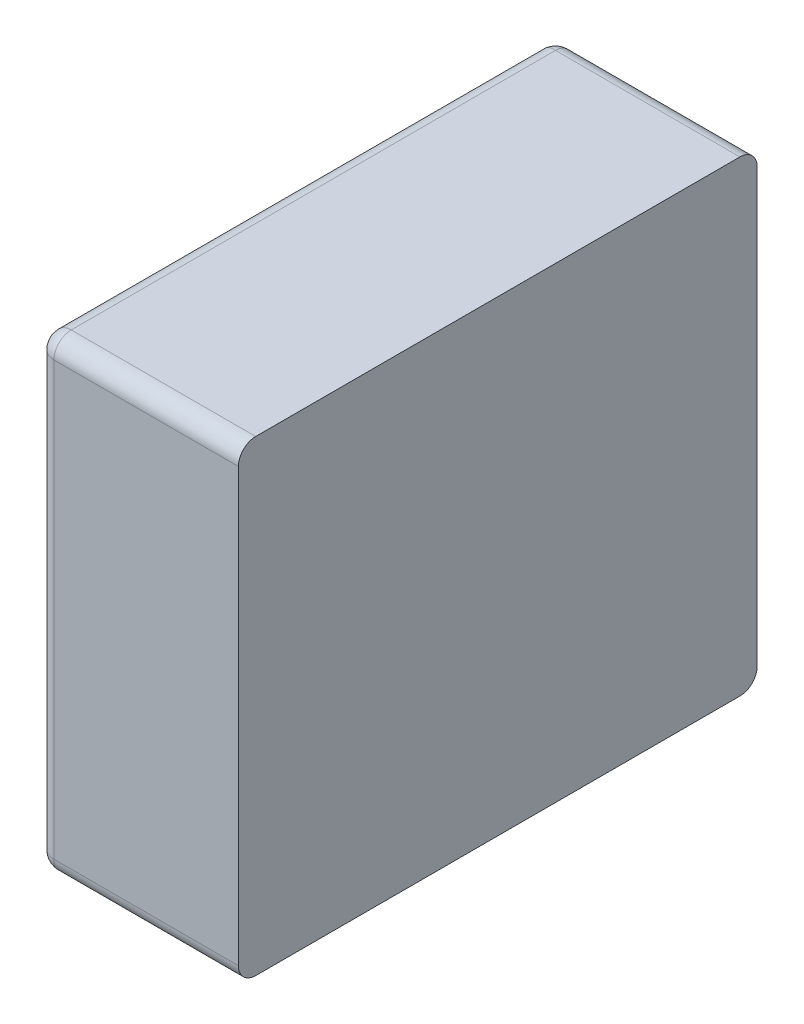
ISO-10303-21;
HEADER;
FILE_DESCRIPTION(('STEP AP214'),'2;1');
FILE_NAME('part.step','',(''),(''),'','','');
FILE_SCHEMA(('AUTOMOTIVE_DESIGN { 1 0 10303 214 1 1 1 1 }'));
ENDSEC;
DATA;
#1=APPLICATION_CONTEXT('core data for automotive mechanical design processes');
#2=APPLICATION_PROTOCOL_DEFINITION('international standard','automotive_design',2000,#1);
#3=PRODUCT_CONTEXT('',#1,'mechanical');
#4=PRODUCT('Part','Part','',(#3));
#5=PRODUCT_RELATED_PRODUCT_CATEGORY('part','',(#4));
#6=PRODUCT_DEFINITION_FORMATION('','',#4);
#7=PRODUCT_DEFINITION_CONTEXT('part definition',#1,'design');
#8=PRODUCT_DEFINITION('design','',#6,#7);
#9=PRODUCT_DEFINITION_SHAPE('','',#8);
#10=(LENGTH_UNIT() NAMED_UNIT(*) SI_UNIT(.MILLI.,.METRE.));
#11=(NAMED_UNIT(*) PLANE_ANGLE_UNIT() SI_UNIT($,.RADIAN.));
#12=(NAMED_UNIT(*) SI_UNIT($,.STERADIAN.) SOLID_ANGLE_UNIT());
#13=UNCERTAINTY_MEASURE_WITH_UNIT(LENGTH_MEASURE(1.E-05),#10,'distance_accuracy_value','');
#14=(GEOMETRIC_REPRESENTATION_CONTEXT(3) GLOBAL_UNCERTAINTY_ASSIGNED_CONTEXT((#13)) GLOBAL_UNIT_ASSIGNED_CONTEXT((#10,
#11,#12)) REPRESENTATION_CONTEXT('',''));
#15=CARTESIAN_POINT('',(0.,0.,0.));
#16=DIRECTION('',(0.,0.,1.));
#17=DIRECTION('',(1.,0.,0.));
#18=AXIS2_PLACEMENT_3D('',#15,#16,#17);
#19=CARTESIAN_POINT('',(-0.77,0.375,0.03));
#20=DIRECTION('',(-0.816496580927725,-0.408248290463864,0.408248290463863));
#21=DIRECTION('',(-0.577350269189627,0.577350269189626,-0.577350269189625));
#22=AXIS2_PLACEMENT_3D('',#19,#20,#21);
#23=SPHERICAL_SURFACE('',#22,0.03);
#24=CARTESIAN_POINT('',(-0.8,0.375,0.03));
#25=CARTESIAN_POINT('',(-0.800000000885541,0.375208920565759,0.0299043319612077));
#26=CARTESIAN_POINT('',(-0.799997360045311,0.3754188571993,0.0298108890156702));
#27=CARTESIAN_POINT('',(-0.799986781704457,0.375841302917413,0.0296280979296212));
#28=CARTESIAN_POINT('',(-0.799978824512546,0.376053818670956,0.0295387663369045));
#29=CARTESIAN_POINT('',(-0.799957560563846,0.376481201194103,0.0293642290897057));
#30=CARTESIAN_POINT('',(-0.79994423389955,0.376696073785566,0.0292790401261315));
#31=CARTESIAN_POINT('',(-0.799912183618114,0.377127947599275,0.0291128108923312));
#32=CARTESIAN_POINT('',(-0.799893439937734,0.377344953783418,0.0290317873885858));
#33=CARTESIAN_POINT('',(-0.799850512107089,0.37778087048501,0.0288739059489271));
#34=CARTESIAN_POINT('',(-0.799826307791658,0.377999785093463,0.0287970647975936));
#35=CARTESIAN_POINT('',(-0.799772419851868,0.378439292053119,0.0286475586064332));
#36=CARTESIAN_POINT('',(-0.799742716016461,0.378659887617396,0.0285749103112036));
#37=CARTESIAN_POINT('',(-0.799677793860668,0.379102531645172,0.0284337933353258));
#38=CARTESIAN_POINT('',(-0.79964255533454,0.37932458245702,0.0283653412999816));
#39=CARTESIAN_POINT('',(-0.799566536092966,0.379769899562591,0.0282326166709339));
#40=CARTESIAN_POINT('',(-0.799525735241222,0.379993167304501,0.0281683605782344));
#41=CARTESIAN_POINT('',(-0.799394737369102,0.380665687375364,0.0279815071011925));
#42=CARTESIAN_POINT('',(-0.79929629941659,0.381115236256513,0.0278655937641843));
#43=CARTESIAN_POINT('',(-0.799077081092125,0.382016435722467,0.0276502506225998));
#44=CARTESIAN_POINT('',(-0.798956143515048,0.38246807783126,0.0275509467609499));
#45=CARTESIAN_POINT('',(-0.79869184908149,0.383371671082917,0.0273685694885411));
#46=CARTESIAN_POINT('',(-0.798548339496165,0.383823601756171,0.0272856160203643));
#47=CARTESIAN_POINT('',(-0.798238911206526,0.384725937163117,0.0271356050355743));
#48=CARTESIAN_POINT('',(-0.798072845692959,0.385176310223073,0.027068660332455));
#49=CARTESIAN_POINT('',(-0.797718393736061,0.386073724852721,0.0269502342175697));
#50=CARTESIAN_POINT('',(-0.797529867626478,0.386520725008768,0.0268988574402047));
#51=CARTESIAN_POINT('',(-0.797130664853887,0.387409608537143,0.0268110444110847));
#52=CARTESIAN_POINT('',(-0.79691985675561,0.387851442274516,0.0267747038269012));
#53=CARTESIAN_POINT('',(-0.796476342722002,0.388728240548299,0.0267163522612807));
#54=CARTESIAN_POINT('',(-0.796243514501363,0.389163148910546,0.0266944274137424));
#55=CARTESIAN_POINT('',(-0.795756296059558,0.390024383436286,0.0266642124365379));
#56=CARTESIAN_POINT('',(-0.795501793454286,0.390450648652353,0.0266559985720434));
#57=CARTESIAN_POINT('',(-0.794971645342014,0.391292931267141,0.0266524308733058));
#58=CARTESIAN_POINT('',(-0.794695897931203,0.391708884767313,0.026657143323895));
#59=CARTESIAN_POINT('',(-0.794123762407378,0.392528933009151,0.02667857848155));
#60=CARTESIAN_POINT('',(-0.793827283277693,0.392932962741796,0.0266953575967929));
#61=CARTESIAN_POINT('',(-0.793214269055406,0.393727614334856,0.026740006309045));
#62=CARTESIAN_POINT('',(-0.792897654069066,0.394118171903413,0.0267679227444279));
#63=CARTESIAN_POINT('',(-0.792245034475514,0.394884398697805,0.0268338617945845));
#64=CARTESIAN_POINT('',(-0.791908961165091,0.395260006134148,0.0268719221736245));
#65=CARTESIAN_POINT('',(-0.79121817154898,0.395994927323628,0.026957106102435));
#66=CARTESIAN_POINT('',(-0.790863397634121,0.396354183506085,0.0270042590105575));
#67=CARTESIAN_POINT('',(-0.790136032021387,0.397055078090956,0.0271065324253754));
#68=CARTESIAN_POINT('',(-0.789763393553022,0.397396664765597,0.0271616747073124));
#69=CARTESIAN_POINT('',(-0.789001200561672,0.398060983194026,0.0272787851655132));
#70=CARTESIAN_POINT('',(-0.788611609698811,0.398383670573753,0.0273407684922153));
#71=CARTESIAN_POINT('',(-0.787816487725631,0.399009045509089,0.0274703798902937));
#72=CARTESIAN_POINT('',(-0.787410930152302,0.399311697423408,0.0275380175610654));
#73=CARTESIAN_POINT('',(-0.786584921848203,0.399895953586706,0.0276777239590771));
#74=CARTESIAN_POINT('',(-0.786164453839678,0.400177532158359,0.0277497979031105));
#75=CARTESIAN_POINT('',(-0.78530973989387,0.400718695200802,0.0278971377116832));
#76=CARTESIAN_POINT('',(-0.784875485043225,0.400978265027613,0.0279724056522169));
#77=CARTESIAN_POINT('',(-0.783994377299662,0.401474569391927,0.0281248761075376));
#78=CARTESIAN_POINT('',(-0.78354752291707,0.401711301214479,0.0282020788509604));
#79=CARTESIAN_POINT('',(-0.782642456850724,0.402161196950527,0.0283571507017665));
#80=CARTESIAN_POINT('',(-0.782184250050681,0.402374370790128,0.028435019513488));
#81=CARTESIAN_POINT('',(-0.781257776631302,0.402776529291588,0.0285901518426264));
#82=CARTESIAN_POINT('',(-0.780789520120333,0.40296553704088,0.0286674158705552));
#83=CARTESIAN_POINT('',(-0.779844297105908,0.403318855688421,0.0288200709744449));
#84=CARTESIAN_POINT('',(-0.779367344700468,0.403483203157651,0.0288954646826547));
#85=CARTESIAN_POINT('',(-0.778406127362682,0.403786808810622,0.029043122926288));
#86=CARTESIAN_POINT('',(-0.777921879210046,0.403926117168614,0.0291153934940245));
#87=CARTESIAN_POINT('',(-0.776947510656095,0.40417936863514,0.0292555680794347));
#88=CARTESIAN_POINT('',(-0.776457408349491,0.404293375435409,0.0293234827482828));
#89=CARTESIAN_POINT('',(-0.775472809014332,0.404495864378045,0.0294537342598498));
#90=CARTESIAN_POINT('',(-0.774978329987218,0.404584423439013,0.0295160875099761));
#91=CARTESIAN_POINT('',(-0.773986488076972,0.404735975701535,0.0296340383799985));
#92=CARTESIAN_POINT('',(-0.773489141663646,0.404799058547557,0.0296896591970139));
#93=CARTESIAN_POINT('',(-0.772493098142923,0.404899728520835,0.0297930071991365));
#94=CARTESIAN_POINT('',(-0.771994414549251,0.404937417339022,0.0298407652826262));
#95=CARTESIAN_POINT('',(-0.770997266674897,0.404987502790529,0.0299272990130659));
#96=CARTESIAN_POINT('',(-0.7704988114566,0.40500001218838,0.0299661140154709));
#97=CARTESIAN_POINT('',(-0.77,0.405,0.0299999999999999));
#98=B_SPLINE_CURVE_WITH_KNOTS('',3,(#24,#25,#26,#27,#28,#29,#30,#31,#32,#33,#34,#35,#36,#37,#38,
#39,#40,#41,#42,#43,#44,#45,#46,#47,#48,#49,#50,#51,#52,#53,#54,#55,#56,#57,#58,#59,#60,#61,#62,
#63,#64,#65,#66,#67,#68,#69,#70,#71,#72,#73,#74,#75,#76,#77,#78,#79,#80,#81,#82,#83,#84,#85,#86,
#87,#88,#89,#90,#91,#92,#93,#94,#95,#96,#97),.UNSPECIFIED.,.F.,.F.,(4,2,2,2,2,2,2,2,2,2,2,2,2,2,
2,2,2,2,2,2,2,2,2,2,2,2,2,2,2,2,2,2,2,2,2,2,4),(0.,0.000689316766648968,0.00138120096010763,
0.00207567429615539,0.00277275348984124,0.00347245028002031,0.00417477146326371,
0.00487971893664834,0.00558728974893888,0.0070101117567409,0.00844327621530548,
0.00988659180487091,0.0113397969739223,0.0128025631197324,0.0142744980597442,0.0157551497509969,
0.0172440102195327,0.0187405196662893,0.0202440707202696,0.0217540128137278,0.0232696566576618,
0.0247902787990631,0.0263151262441233,0.0278434211339502,0.0293743654613289,0.0309071458186774,
0.032440938168626,0.0339749126296049,0.0355082382694748,0.0370400879005887,0.0385696428697322,
0.0400960978361721,0.0416186655305149,0.0431365814862649,0.0446491087348324,0.0461555424532762,
0.0476552145522494),.UNSPECIFIED.);
#99=CARTESIAN_POINT('',(-0.8,0.375,0.03));
#100=VERTEX_POINT('',#99);
#101=CARTESIAN_POINT('',(-0.77,0.405,0.03));
#102=VERTEX_POINT('',#101);
#103=EDGE_CURVE('E11',#100,#102,#98,.T.);
#104=ORIENTED_EDGE('',*,*,#103,.T.);
#105=CARTESIAN_POINT('',(-0.77,0.375,0.03));
#106=DIRECTION('',(-1.,0.,0.));
#107=DIRECTION('',(0.,0.,-1.));
#108=AXIS2_PLACEMENT_3D('',#105,#106,#107);
#109=CIRCLE('',#108,0.03);
#110=CARTESIAN_POINT('',(-0.77,0.375,0.));
#111=VERTEX_POINT('',#110);
#112=EDGE_CURVE('E25',#102,#111,#109,.T.);
#113=ORIENTED_EDGE('',*,*,#112,.T.);
#114=CARTESIAN_POINT('',(-0.77,0.375,0.03));
#115=DIRECTION('',(0.,1.,0.));
#116=DIRECTION('',(-1.,0.,0.));
#117=AXIS2_PLACEMENT_3D('',#114,#115,#116);
#118=CIRCLE('',#117,0.03);
#119=EDGE_CURVE('E248',#111,#100,#118,.T.);
#120=ORIENTED_EDGE('',*,*,#119,.T.);
#121=EDGE_LOOP('',(#104,#113,#120));
#122=FACE_BOUND('',#121,.T.);
#123=ADVANCED_FACE('F17',(#122),#23,.T.);
#124=CARTESIAN_POINT('',(-0.4,0.375,0.03));
#125=DIRECTION('',(-1.,0.,0.));
#126=DIRECTION('',(0.,0.707106781186548,-0.707106781186547));
#127=AXIS2_PLACEMENT_3D('',#124,#125,#126);
#128=CYLINDRICAL_SURFACE('',#127,0.03);
#129=CARTESIAN_POINT('',(-0.45,0.375,0.03));
#130=DIRECTION('',(-1.,0.,0.));
#131=DIRECTION('',(0.,0.707106781186548,-0.707106781186547));
#132=AXIS2_PLACEMENT_3D('',#129,#130,#131);
#133=CIRCLE('',#132,0.03);
#134=CARTESIAN_POINT('',(-0.45,0.405,0.03));
#135=VERTEX_POINT('',#134);
#136=CARTESIAN_POINT('',(-0.45,0.375,0.));
#137=VERTEX_POINT('',#136);
#138=EDGE_CURVE('E246',#135,#137,#133,.T.);
#139=ORIENTED_EDGE('',*,*,#138,.T.);
#140=DIRECTION('',(-1.,0.,0.));
#141=VECTOR('',#140,1.);
#142=CARTESIAN_POINT('',(-0.4,0.375,0.));
#143=LINE('',#142,#141);
#144=EDGE_CURVE('E243',#137,#111,#143,.T.);
#145=ORIENTED_EDGE('',*,*,#144,.T.);
#146=ORIENTED_EDGE('',*,*,#112,.F.);
#147=DIRECTION('',(1.,0.,0.));
#148=VECTOR('',#147,1.);
#149=CARTESIAN_POINT('',(-0.4,0.405,0.03));
#150=LINE('',#149,#148);
#151=EDGE_CURVE('E238',#102,#135,#150,.T.);
#152=ORIENTED_EDGE('',*,*,#151,.T.);
#153=EDGE_LOOP('',(#139,#145,#146,#152));
#154=FACE_BOUND('',#153,.T.);
#155=ADVANCED_FACE('F278',(#154),#128,.T.);
#156=CARTESIAN_POINT('',(-0.77,-0.375,0.03));
#157=DIRECTION('',(-0.816496580927727,0.408248290463863,0.408248290463862));
#158=DIRECTION('',(-0.577350269189625,-0.577350269189627,-0.577350269189626));
#159=AXIS2_PLACEMENT_3D('',#156,#157,#158);
#160=SPHERICAL_SURFACE('',#159,0.03);
#161=CARTESIAN_POINT('',(-0.77,-0.375,0.03));
#162=DIRECTION('',(0.,-1.,0.));
#163=DIRECTION('',(0.,0.,-1.));
#164=AXIS2_PLACEMENT_3D('',#161,#162,#163);
#165=CIRCLE('',#164,0.03);
#166=CARTESIAN_POINT('',(-0.8,-0.375,0.03));
#167=VERTEX_POINT('',#166);
#168=CARTESIAN_POINT('',(-0.77,-0.375,0.));
#169=VERTEX_POINT('',#168);
#170=EDGE_CURVE('E236',#167,#169,#165,.T.);
#171=ORIENTED_EDGE('',*,*,#170,.T.);
#172=CARTESIAN_POINT('',(-0.77,-0.375,0.03));
#173=DIRECTION('',(-1.,0.,0.));
#174=DIRECTION('',(0.,-1.,0.));
#175=AXIS2_PLACEMENT_3D('',#172,#173,#174);
#176=CIRCLE('',#175,0.03);
#177=CARTESIAN_POINT('',(-0.77,-0.405,0.03));
#178=VERTEX_POINT('',#177);
#179=EDGE_CURVE('E234',#169,#178,#176,.T.);
#180=ORIENTED_EDGE('',*,*,#179,.T.);
#181=CARTESIAN_POINT('',(-0.77,-0.375,0.03));
#182=DIRECTION('',(0.,0.,-1.));
#183=DIRECTION('',(-1.,0.,0.));
#184=AXIS2_PLACEMENT_3D('',#181,#182,#183);
#185=CIRCLE('',#184,0.03);
#186=EDGE_CURVE('E231',#178,#167,#185,.T.);
#187=ORIENTED_EDGE('',*,*,#186,.T.);
#188=EDGE_LOOP('',(#171,#180,#187));
#189=FACE_BOUND('',#188,.T.);
#190=ADVANCED_FACE('F290',(#189),#160,.T.);
#191=CARTESIAN_POINT('',(0.4,-0.375,0.03));
#192=DIRECTION('',(1.,0.,0.));
#193=DIRECTION('',(0.,-0.707106781186548,-0.707106781186547));
#194=AXIS2_PLACEMENT_3D('',#191,#192,#193);
#195=CYLINDRICAL_SURFACE('',#194,0.03);
#196=CARTESIAN_POINT('',(-0.45,-0.375,0.03));
#197=DIRECTION('',(-1.,0.,0.));
#198=DIRECTION('',(0.,-0.707106781186548,-0.707106781186547));
#199=AXIS2_PLACEMENT_3D('',#196,#197,#198);
#200=CIRCLE('',#199,0.03);
#201=CARTESIAN_POINT('',(-0.45,-0.375,0.));
#202=VERTEX_POINT('',#201);
#203=CARTESIAN_POINT('',(-0.45,-0.405,0.03));
#204=VERTEX_POINT('',#203);
#205=EDGE_CURVE('E229',#202,#204,#200,.T.);
#206=ORIENTED_EDGE('',*,*,#205,.T.);
#207=DIRECTION('',(-1.,0.,0.));
#208=VECTOR('',#207,1.);
#209=CARTESIAN_POINT('',(0.4,-0.405,0.03));
#210=LINE('',#209,#208);
#211=EDGE_CURVE('E226',#204,#178,#210,.T.);
#212=ORIENTED_EDGE('',*,*,#211,.T.);
#213=ORIENTED_EDGE('',*,*,#179,.F.);
#214=DIRECTION('',(1.,0.,0.));
#215=VECTOR('',#214,1.);
#216=CARTESIAN_POINT('',(0.4,-0.375,0.));
#217=LINE('',#216,#215);
#218=EDGE_CURVE('E223',#169,#202,#217,.T.);
#219=ORIENTED_EDGE('',*,*,#218,.T.);
#220=EDGE_LOOP('',(#206,#212,#213,#219));
#221=FACE_BOUND('',#220,.T.);
#222=ADVANCED_FACE('F285',(#221),#195,.T.);
#223=CARTESIAN_POINT('',(-0.77,0.375,0.87));
#224=DIRECTION('',(-0.408248290463864,-0.816496580927725,0.408248290463864));
#225=DIRECTION('',(-0.577350269189625,0.577350269189627,0.577350269189625));
#226=AXIS2_PLACEMENT_3D('',#223,#224,#225);
#227=SPHERICAL_SURFACE('',#226,0.03);
#228=CARTESIAN_POINT('',(-0.77,0.375,0.87));
#229=DIRECTION('',(-1.,0.,0.));
#230=DIRECTION('',(0.,1.,0.));
#231=AXIS2_PLACEMENT_3D('',#228,#229,#230);
#232=CIRCLE('',#231,0.03);
#233=CARTESIAN_POINT('',(-0.77,0.375,0.9));
#234=VERTEX_POINT('',#233);
#235=CARTESIAN_POINT('',(-0.77,0.405,0.87));
#236=VERTEX_POINT('',#235);
#237=EDGE_CURVE('E108',#234,#236,#232,.T.);
#238=ORIENTED_EDGE('',*,*,#237,.T.);
#239=CARTESIAN_POINT('',(-0.77,0.375,0.87));
#240=DIRECTION('',(0.,0.,1.));
#241=DIRECTION('',(-1.,0.,0.));
#242=AXIS2_PLACEMENT_3D('',#239,#240,#241);
#243=CIRCLE('',#242,0.03);
#244=CARTESIAN_POINT('',(-0.8,0.375,0.87));
#245=VERTEX_POINT('',#244);
#246=EDGE_CURVE('E220',#236,#245,#243,.T.);
#247=ORIENTED_EDGE('',*,*,#246,.T.);
#248=CARTESIAN_POINT('',(-0.77,0.375,0.87));
#249=DIRECTION('',(0.,1.,0.));
#250=DIRECTION('',(0.,0.,1.));
#251=AXIS2_PLACEMENT_3D('',#248,#249,#250);
#252=CIRCLE('',#251,0.03);
#253=EDGE_CURVE('E218',#245,#234,#252,.T.);
#254=ORIENTED_EDGE('',*,*,#253,.T.);
#255=EDGE_LOOP('',(#238,#247,#254));
#256=FACE_BOUND('',#255,.T.);
#257=ADVANCED_FACE('F322',(#256),#227,.T.);
#258=CARTESIAN_POINT('',(-0.77,0.375,0.));
#259=DIRECTION('',(0.,0.,1.));
#260=DIRECTION('',(-0.707106781186548,0.707106781186548,0.));
#261=AXIS2_PLACEMENT_3D('',#258,#259,#260);
#262=CYLINDRICAL_SURFACE('',#261,0.03);
#263=ORIENTED_EDGE('',*,*,#246,.F.);
#264=DIRECTION('',(0.,0.,-1.));
#265=VECTOR('',#264,1.);
#266=CARTESIAN_POINT('',(-0.77,0.405,0.));
#267=LINE('',#266,#265);
#268=EDGE_CURVE('E214',#236,#102,#267,.T.);
#269=ORIENTED_EDGE('',*,*,#268,.T.);
#270=ORIENTED_EDGE('',*,*,#103,.F.);
#271=DIRECTION('',(0.,0.,1.));
#272=VECTOR('',#271,1.);
#273=CARTESIAN_POINT('',(-0.8,0.375,0.));
#274=LINE('',#273,#272);
#275=EDGE_CURVE('E210',#100,#245,#274,.T.);
#276=ORIENTED_EDGE('',*,*,#275,.T.);
#277=EDGE_LOOP('',(#263,#269,#270,#276));
#278=FACE_BOUND('',#277,.T.);
#279=ADVANCED_FACE('F188',(#278),#262,.T.);
#280=CARTESIAN_POINT('',(-0.77,-0.375,0.87));
#281=DIRECTION('',(0.408248290463864,-0.816496580927725,-0.408248290463864));
#282=DIRECTION('',(-0.577350269189625,-0.577350269189627,0.577350269189625));
#283=AXIS2_PLACEMENT_3D('',#280,#281,#282);
#284=SPHERICAL_SURFACE('',#283,0.03);
#285=CARTESIAN_POINT('',(-0.77,-0.375,0.87));
#286=DIRECTION('',(0.,-1.,0.));
#287=DIRECTION('',(-1.,0.,0.));
#288=AXIS2_PLACEMENT_3D('',#285,#286,#287);
#289=CIRCLE('',#288,0.03);
#290=CARTESIAN_POINT('',(-0.77,-0.375,0.9));
#291=VERTEX_POINT('',#290);
#292=CARTESIAN_POINT('',(-0.8,-0.375,0.87));
#293=VERTEX_POINT('',#292);
#294=EDGE_CURVE('E206',#291,#293,#289,.T.);
#295=ORIENTED_EDGE('',*,*,#294,.T.);
#296=CARTESIAN_POINT('',(-0.77,-0.375,0.87));
#297=DIRECTION('',(0.,0.,1.));
#298=DIRECTION('',(0.,-1.,0.));
#299=AXIS2_PLACEMENT_3D('',#296,#297,#298);
#300=CIRCLE('',#299,0.03);
#301=CARTESIAN_POINT('',(-0.77,-0.405,0.87));
#302=VERTEX_POINT('',#301);
#303=EDGE_CURVE('E204',#293,#302,#300,.T.);
#304=ORIENTED_EDGE('',*,*,#303,.T.);
#305=CARTESIAN_POINT('',(-0.77,-0.405,0.87));
#306=CARTESIAN_POINT('',(-0.770095668038792,-0.405000000885541,0.870208920565759));
#307=CARTESIAN_POINT('',(-0.77018911098433,-0.404997360045311,0.8704188571993));
#308=CARTESIAN_POINT('',(-0.770371902070379,-0.404986781704457,0.870841302917413));
#309=CARTESIAN_POINT('',(-0.770461233663096,-0.404978824512546,0.871053818670956));
#310=CARTESIAN_POINT('',(-0.770635770910294,-0.404957560563846,0.871481201194103));
#311=CARTESIAN_POINT('',(-0.770720959873869,-0.40494423389955,0.871696073785566));
#312=CARTESIAN_POINT('',(-0.770887189107669,-0.404912183618114,0.872127947599275));
#313=CARTESIAN_POINT('',(-0.770968212611414,-0.404893439937734,0.872344953783418));
#314=CARTESIAN_POINT('',(-0.771126094051073,-0.404850512107089,0.87278087048501));
#315=CARTESIAN_POINT('',(-0.771202935202406,-0.404826307791658,0.872999785093463));
#316=CARTESIAN_POINT('',(-0.771352441393567,-0.404772419851868,0.873439292053119));
#317=CARTESIAN_POINT('',(-0.771425089688797,-0.404742716016461,0.873659887617396));
#318=CARTESIAN_POINT('',(-0.771566206664674,-0.404677793860667,0.874102531645172));
#319=CARTESIAN_POINT('',(-0.771634658700019,-0.40464255533454,0.874324582457019));
#320=CARTESIAN_POINT('',(-0.771767383329066,-0.404566536092966,0.874769899562591));
#321=CARTESIAN_POINT('',(-0.771831639421766,-0.404525735241222,0.8749931673045));
#322=CARTESIAN_POINT('',(-0.772018492898808,-0.404394737369101,0.875665687375364));
#323=CARTESIAN_POINT('',(-0.772134406235816,-0.40429629941659,0.876115236256513));
#324=CARTESIAN_POINT('',(-0.7723497493774,-0.404077081092125,0.877016435722467));
#325=CARTESIAN_POINT('',(-0.77244905323905,-0.403956143515048,0.87746807783126));
#326=CARTESIAN_POINT('',(-0.772631430511459,-0.40369184908149,0.878371671082917));
#327=CARTESIAN_POINT('',(-0.772714383979636,-0.403548339496165,0.878823601756171));
#328=CARTESIAN_POINT('',(-0.772864394964426,-0.403238911206526,0.879725937163117));
#329=CARTESIAN_POINT('',(-0.772931339667545,-0.403072845692959,0.880176310223072));
#330=CARTESIAN_POINT('',(-0.77304976578243,-0.402718393736061,0.881073724852721));
#331=CARTESIAN_POINT('',(-0.773101142559795,-0.402529867626478,0.881520725008768));
#332=CARTESIAN_POINT('',(-0.773188955588915,-0.402130664853887,0.882409608537143));
#333=CARTESIAN_POINT('',(-0.773225296173099,-0.40191985675561,0.882851442274516));
#334=CARTESIAN_POINT('',(-0.773283647738719,-0.401476342722002,0.883728240548299));
#335=CARTESIAN_POINT('',(-0.773305572586258,-0.401243514501363,0.884163148910546));
#336=CARTESIAN_POINT('',(-0.773335787563462,-0.400756296059558,0.885024383436286));
#337=CARTESIAN_POINT('',(-0.773344001427957,-0.400501793454286,0.885450648652353));
#338=CARTESIAN_POINT('',(-0.773347569126694,-0.399971645342014,0.886292931267141));
#339=CARTESIAN_POINT('',(-0.773342856676105,-0.399695897931203,0.886708884767313));
#340=CARTESIAN_POINT('',(-0.77332142151845,-0.399123762407378,0.887528933009151));
#341=CARTESIAN_POINT('',(-0.773304642403207,-0.398827283277693,0.887932962741796));
#342=CARTESIAN_POINT('',(-0.773259993690955,-0.398214269055406,0.888727614334856));
#343=CARTESIAN_POINT('',(-0.773232077255572,-0.397897654069066,0.889118171903412));
#344=CARTESIAN_POINT('',(-0.773166138205415,-0.397245034475513,0.889884398697804));
#345=CARTESIAN_POINT('',(-0.773128077826375,-0.396908961165091,0.890260006134148));
#346=CARTESIAN_POINT('',(-0.773042893897565,-0.39621817154898,0.890994927323628));
#347=CARTESIAN_POINT('',(-0.772995740989442,-0.395863397634121,0.891354183506085));
#348=CARTESIAN_POINT('',(-0.772893467574625,-0.395136032021387,0.892055078090956));
#349=CARTESIAN_POINT('',(-0.772838325292687,-0.394763393553022,0.892396664765597));
#350=CARTESIAN_POINT('',(-0.772721214834487,-0.394001200561671,0.893060983194026));
#351=CARTESIAN_POINT('',(-0.772659231507785,-0.393611609698811,0.893383670573753));
#352=CARTESIAN_POINT('',(-0.772529620109706,-0.392816487725631,0.894009045509088));
#353=CARTESIAN_POINT('',(-0.772461982438935,-0.392410930152302,0.894311697423408));
#354=CARTESIAN_POINT('',(-0.772322276040923,-0.391584921848203,0.894895953586706));
#355=CARTESIAN_POINT('',(-0.772250202096889,-0.391164453839678,0.895177532158358));
#356=CARTESIAN_POINT('',(-0.772102862288317,-0.39030973989387,0.895718695200802));
#357=CARTESIAN_POINT('',(-0.772027594347783,-0.389875485043225,0.895978265027613));
#358=CARTESIAN_POINT('',(-0.771875123892462,-0.388994377299662,0.896474569391927));
#359=CARTESIAN_POINT('',(-0.77179792114904,-0.38854752291707,0.896711301214479));
#360=CARTESIAN_POINT('',(-0.771642849298233,-0.387642456850724,0.897161196950527));
#361=CARTESIAN_POINT('',(-0.771564980486512,-0.387184250050681,0.897374370790128));
#362=CARTESIAN_POINT('',(-0.771409848157373,-0.386257776631302,0.897776529291588));
#363=CARTESIAN_POINT('',(-0.771332584129445,-0.385789520120332,0.89796553704088));
#364=CARTESIAN_POINT('',(-0.771179929025555,-0.384844297105908,0.898318855688421));
#365=CARTESIAN_POINT('',(-0.771104535317345,-0.384367344700468,0.898483203157651));
#366=CARTESIAN_POINT('',(-0.770956877073712,-0.383406127362682,0.898786808810621));
#367=CARTESIAN_POINT('',(-0.770884606505975,-0.382921879210045,0.898926117168614));
#368=CARTESIAN_POINT('',(-0.770744431920565,-0.381947510656095,0.89917936863514));
#369=CARTESIAN_POINT('',(-0.770676517251717,-0.381457408349491,0.899293375435409));
#370=CARTESIAN_POINT('',(-0.77054626574015,-0.380472809014332,0.899495864378045));
#371=CARTESIAN_POINT('',(-0.770483912490024,-0.379978329987218,0.899584423439013));
#372=CARTESIAN_POINT('',(-0.770365961620001,-0.378986488076972,0.899735975701535));
#373=CARTESIAN_POINT('',(-0.770310340802986,-0.378489141663646,0.899799058547557));
#374=CARTESIAN_POINT('',(-0.770206992800863,-0.377493098142923,0.899899728520835));
#375=CARTESIAN_POINT('',(-0.770159234717374,-0.376994414549251,0.899937417339022));
#376=CARTESIAN_POINT('',(-0.770072700986934,-0.375997266674897,0.899987502790529));
#377=CARTESIAN_POINT('',(-0.770033885984529,-0.3754988114566,0.90000001218838));
#378=CARTESIAN_POINT('',(-0.77,-0.375,0.9));
#379=B_SPLINE_CURVE_WITH_KNOTS('',3,(#305,#306,#307,#308,#309,#310,#311,#312,#313,#314,#315,
#316,#317,#318,#319,#320,#321,#322,#323,#324,#325,#326,#327,#328,#329,#330,#331,#332,#333,#334,
#335,#336,#337,#338,#339,#340,#341,#342,#343,#344,#345,#346,#347,#348,#349,#350,#351,#352,#353,
#354,#355,#356,#357,#358,#359,#360,#361,#362,#363,#364,#365,#366,#367,#368,#369,#370,#371,#372,
#373,#374,#375,#376,#377,#378),.UNSPECIFIED.,.F.,.F.,(4,2,2,2,2,2,2,2,2,2,2,2,2,2,2,2,2,2,2,2,2,
2,2,2,2,2,2,2,2,2,2,2,2,2,2,2,4),(0.,0.000689316766648959,0.0013812009601076,
0.00207567429615537,0.00277275348984118,0.00347245028002033,0.00417477146326372,
0.00487971893664836,0.0055872897489389,0.0070101117567409,0.00844327621530554,
0.00988659180487091,0.0113397969739223,0.0128025631197325,0.0142744980597442,0.0157551497509969,
0.0172440102195328,0.0187405196662893,0.0202440707202697,0.0217540128137279,0.0232696566576618,
0.0247902787990631,0.0263151262441234,0.0278434211339502,0.0293743654613289,0.0309071458186775,
0.0324409381686261,0.0339749126296049,0.0355082382694749,0.0370400879005888,0.0385696428697324,
0.0400960978361723,0.041618665530515,0.043136581486265,0.0446491087348325,0.0461555424532764,
0.0476552145522495),.UNSPECIFIED.);
#380=EDGE_CURVE('E160',#302,#291,#379,.T.);
#381=ORIENTED_EDGE('',*,*,#380,.T.);
#382=EDGE_LOOP('',(#295,#304,#381));
#383=FACE_BOUND('',#382,.T.);
#384=ADVANCED_FACE('F183',(#383),#284,.T.);
#385=CARTESIAN_POINT('',(-0.77,-0.375,0.));
#386=DIRECTION('',(0.,0.,1.));
#387=DIRECTION('',(-0.707106781186548,-0.707106781186548,0.));
#388=AXIS2_PLACEMENT_3D('',#385,#386,#387);
#389=CYLINDRICAL_SURFACE('',#388,0.03);
#390=ORIENTED_EDGE('',*,*,#303,.F.);
#391=DIRECTION('',(0.,0.,-1.));
#392=VECTOR('',#391,1.);
#393=CARTESIAN_POINT('',(-0.8,-0.375,0.));
#394=LINE('',#393,#392);
#395=EDGE_CURVE('E157',#293,#167,#394,.T.);
#396=ORIENTED_EDGE('',*,*,#395,.T.);
#397=ORIENTED_EDGE('',*,*,#186,.F.);
#398=DIRECTION('',(0.,0.,1.));
#399=VECTOR('',#398,1.);
#400=CARTESIAN_POINT('',(-0.77,-0.405,0.));
#401=LINE('',#400,#399);
#402=EDGE_CURVE('E152',#178,#302,#401,.T.);
#403=ORIENTED_EDGE('',*,*,#402,.T.);
#404=EDGE_LOOP('',(#390,#396,#397,#403));
#405=FACE_BOUND('',#404,.T.);
#406=ADVANCED_FACE('F178',(#405),#389,.T.);
#407=CARTESIAN_POINT('',(0.4,-0.375,0.87));
#408=DIRECTION('',(-1.,0.,0.));
#409=DIRECTION('',(0.,-0.707106781186548,0.707106781186548));
#410=AXIS2_PLACEMENT_3D('',#407,#408,#409);
#411=CYLINDRICAL_SURFACE('',#410,0.03);
#412=CARTESIAN_POINT('',(-0.45,-0.375,0.87));
#413=DIRECTION('',(-1.,0.,0.));
#414=DIRECTION('',(0.,-0.707106781186548,0.707106781186548));
#415=AXIS2_PLACEMENT_3D('',#412,#413,#414);
#416=CIRCLE('',#415,0.03);
#417=CARTESIAN_POINT('',(-0.45,-0.405,0.87));
#418=VERTEX_POINT('',#417);
#419=CARTESIAN_POINT('',(-0.45,-0.375,0.9));
#420=VERTEX_POINT('',#419);
#421=EDGE_CURVE('E150',#418,#420,#416,.T.);
#422=ORIENTED_EDGE('',*,*,#421,.T.);
#423=DIRECTION('',(-1.,0.,0.));
#424=VECTOR('',#423,1.);
#425=CARTESIAN_POINT('',(0.4,-0.375,0.9));
#426=LINE('',#425,#424);
#427=EDGE_CURVE('E117',#420,#291,#426,.T.);
#428=ORIENTED_EDGE('',*,*,#427,.T.);
#429=ORIENTED_EDGE('',*,*,#380,.F.);
#430=DIRECTION('',(1.,0.,0.));
#431=VECTOR('',#430,1.);
#432=CARTESIAN_POINT('',(0.4,-0.405,0.87));
#433=LINE('',#432,#431);
#434=EDGE_CURVE('E142',#302,#418,#433,.T.);
#435=ORIENTED_EDGE('',*,*,#434,.T.);
#436=EDGE_LOOP('',(#422,#428,#429,#435));
#437=FACE_BOUND('',#436,.T.);
#438=ADVANCED_FACE('F167',(#437),#411,.T.);
#439=CARTESIAN_POINT('',(-0.77,-0.2025,0.87));
#440=DIRECTION('',(0.,1.,0.));
#441=DIRECTION('',(-0.707106781186548,0.,0.707106781186548));
#442=AXIS2_PLACEMENT_3D('',#439,#440,#441);
#443=CYLINDRICAL_SURFACE('',#442,0.03);
#444=ORIENTED_EDGE('',*,*,#253,.F.);
#445=DIRECTION('',(0.,-1.,0.));
#446=VECTOR('',#445,1.);
#447=CARTESIAN_POINT('',(-0.8,-0.2025,0.87));
#448=LINE('',#447,#446);
#449=EDGE_CURVE('E139',#245,#293,#448,.T.);
#450=ORIENTED_EDGE('',*,*,#449,.T.);
#451=ORIENTED_EDGE('',*,*,#294,.F.);
#452=DIRECTION('',(0.,1.,0.));
#453=VECTOR('',#452,1.);
#454=CARTESIAN_POINT('',(-0.77,-0.2025,0.9));
#455=LINE('',#454,#453);
#456=EDGE_CURVE('E102',#291,#234,#455,.T.);
#457=ORIENTED_EDGE('',*,*,#456,.T.);
#458=EDGE_LOOP('',(#444,#450,#451,#457));
#459=FACE_BOUND('',#458,.T.);
#460=ADVANCED_FACE('F177',(#459),#443,.T.);
#461=CARTESIAN_POINT('',(-0.4,0.375,0.87));
#462=DIRECTION('',(1.,0.,0.));
#463=DIRECTION('',(0.,0.707106781186548,0.707106781186548));
#464=AXIS2_PLACEMENT_3D('',#461,#462,#463);
#465=CYLINDRICAL_SURFACE('',#464,0.03);
#466=CARTESIAN_POINT('',(-0.45,0.375,0.87));
#467=DIRECTION('',(-1.,0.,0.));
#468=DIRECTION('',(0.,0.707106781186548,0.707106781186548));
#469=AXIS2_PLACEMENT_3D('',#466,#467,#468);
#470=CIRCLE('',#469,0.03);
#471=CARTESIAN_POINT('',(-0.45,0.375,0.9));
#472=VERTEX_POINT('',#471);
#473=CARTESIAN_POINT('',(-0.45,0.405,0.87));
#474=VERTEX_POINT('',#473);
#475=EDGE_CURVE('E92',#472,#474,#470,.T.);
#476=ORIENTED_EDGE('',*,*,#475,.T.);
#477=DIRECTION('',(-1.,0.,0.));
#478=VECTOR('',#477,1.);
#479=CARTESIAN_POINT('',(-0.4,0.405,0.87));
#480=LINE('',#479,#478);
#481=EDGE_CURVE('E103',#474,#236,#480,.T.);
#482=ORIENTED_EDGE('',*,*,#481,.T.);
#483=ORIENTED_EDGE('',*,*,#237,.F.);
#484=DIRECTION('',(1.,0.,0.));
#485=VECTOR('',#484,1.);
#486=CARTESIAN_POINT('',(-0.4,0.375,0.9));
#487=LINE('',#486,#485);
#488=EDGE_CURVE('E106',#234,#472,#487,.T.);
#489=ORIENTED_EDGE('',*,*,#488,.T.);
#490=EDGE_LOOP('',(#476,#482,#483,#489));
#491=FACE_BOUND('',#490,.T.);
#492=ADVANCED_FACE('F107',(#491),#465,.T.);
#493=CARTESIAN_POINT('',(-0.77,-0.2025,0.03));
#494=DIRECTION('',(0.,-1.,0.));
#495=DIRECTION('',(-0.707106781186548,0.,-0.707106781186547));
#496=AXIS2_PLACEMENT_3D('',#493,#494,#495);
#497=CYLINDRICAL_SURFACE('',#496,0.03);
#498=ORIENTED_EDGE('',*,*,#170,.F.);
#499=DIRECTION('',(0.,1.,0.));
#500=VECTOR('',#499,1.);
#501=CARTESIAN_POINT('',(-0.8,-0.2025,0.03));
#502=LINE('',#501,#500);
#503=EDGE_CURVE('E112',#167,#100,#502,.T.);
#504=ORIENTED_EDGE('',*,*,#503,.T.);
#505=ORIENTED_EDGE('',*,*,#119,.F.);
#506=DIRECTION('',(0.,-1.,0.));
#507=VECTOR('',#506,1.);
#508=CARTESIAN_POINT('',(-0.77,-0.2025,0.));
#509=LINE('',#508,#507);
#510=EDGE_CURVE('E127',#111,#169,#509,.T.);
#511=ORIENTED_EDGE('',*,*,#510,.T.);
#512=EDGE_LOOP('',(#498,#504,#505,#511));
#513=FACE_BOUND('',#512,.T.);
#514=ADVANCED_FACE('F274',(#513),#497,.T.);
#515=CARTESIAN_POINT('',(0.,0.,0.));
#516=DIRECTION('',(0.,0.,-1.));
#517=DIRECTION('',(-1.,0.,0.));
#518=AXIS2_PLACEMENT_3D('',#515,#516,#517);
#519=PLANE('',#518);
#520=ORIENTED_EDGE('',*,*,#218,.F.);
#521=ORIENTED_EDGE('',*,*,#510,.F.);
#522=ORIENTED_EDGE('',*,*,#144,.F.);
#523=DIRECTION('',(0.,-1.,0.));
#524=VECTOR('',#523,1.);
#525=CARTESIAN_POINT('',(-0.45,0.,0.));
#526=LINE('',#525,#524);
#527=EDGE_CURVE('E120',#137,#202,#526,.T.);
#528=ORIENTED_EDGE('',*,*,#527,.T.);
#529=EDGE_LOOP('',(#520,#521,#522,#528));
#530=FACE_BOUND('',#529,.T.);
#531=ADVANCED_FACE('F282',(#530),#519,.T.);
#532=CARTESIAN_POINT('',(-0.8,0.405,0.));
#533=DIRECTION('',(0.,-1.,0.));
#534=DIRECTION('',(1.,0.,0.));
#535=AXIS2_PLACEMENT_3D('',#532,#533,#534);
#536=PLANE('',#535);
#537=ORIENTED_EDGE('',*,*,#151,.F.);
#538=ORIENTED_EDGE('',*,*,#268,.F.);
#539=ORIENTED_EDGE('',*,*,#481,.F.);
#540=DIRECTION('',(0.,0.,-1.));
#541=VECTOR('',#540,1.);
#542=CARTESIAN_POINT('',(-0.45,0.405,0.225));
#543=LINE('',#542,#541);
#544=EDGE_CURVE('E98',#474,#135,#543,.T.);
#545=ORIENTED_EDGE('',*,*,#544,.T.);
#546=EDGE_LOOP('',(#537,#538,#539,#545));
#547=FACE_BOUND('',#546,.T.);
#548=ADVANCED_FACE('F302',(#547),#536,.F.);
#549=CARTESIAN_POINT('',(-0.8,-0.405,0.));
#550=DIRECTION('',(1.,0.,0.));
#551=DIRECTION('',(0.,1.,0.));
#552=AXIS2_PLACEMENT_3D('',#549,#550,#551);
#553=PLANE('',#552);
#554=ORIENTED_EDGE('',*,*,#395,.F.);
#555=ORIENTED_EDGE('',*,*,#449,.F.);
#556=ORIENTED_EDGE('',*,*,#275,.F.);
#557=ORIENTED_EDGE('',*,*,#503,.F.);
#558=EDGE_LOOP('',(#554,#555,#556,#557));
#559=FACE_BOUND('',#558,.T.);
#560=ADVANCED_FACE('F296',(#559),#553,.F.);
#561=CARTESIAN_POINT('',(-0.45,0.,0.45));
#562=DIRECTION('',(-1.,0.,0.));
#563=DIRECTION('',(0.,0.,1.));
#564=AXIS2_PLACEMENT_3D('',#561,#562,#563);
#565=PLANE('',#564);
#566=ORIENTED_EDGE('',*,*,#205,.F.);
#567=ORIENTED_EDGE('',*,*,#527,.F.);
#568=ORIENTED_EDGE('',*,*,#138,.F.);
#569=ORIENTED_EDGE('',*,*,#544,.F.);
#570=ORIENTED_EDGE('',*,*,#475,.F.);
#571=DIRECTION('',(0.,1.,0.));
#572=VECTOR('',#571,1.);
#573=CARTESIAN_POINT('',(-0.45,0.,0.9));
#574=LINE('',#573,#572);
#575=EDGE_CURVE('E96',#420,#472,#574,.T.);
#576=ORIENTED_EDGE('',*,*,#575,.F.);
#577=ORIENTED_EDGE('',*,*,#421,.F.);
#578=DIRECTION('',(0.,0.,1.));
#579=VECTOR('',#578,1.);
#580=CARTESIAN_POINT('',(-0.45,-0.405,0.225));
#581=LINE('',#580,#579);
#582=EDGE_CURVE('E118',#204,#418,#581,.T.);
#583=ORIENTED_EDGE('',*,*,#582,.F.);
#584=EDGE_LOOP('',(#566,#567,#568,#569,#570,#576,#577,#583));
#585=FACE_BOUND('',#584,.T.);
#586=ADVANCED_FACE('F94',(#585),#565,.F.);
#587=CARTESIAN_POINT('',(0.8,-0.405,0.));
#588=DIRECTION('',(0.,1.,0.));
#589=DIRECTION('',(-1.,0.,0.));
#590=AXIS2_PLACEMENT_3D('',#587,#588,#589);
#591=PLANE('',#590);
#592=ORIENTED_EDGE('',*,*,#211,.F.);
#593=ORIENTED_EDGE('',*,*,#582,.T.);
#594=ORIENTED_EDGE('',*,*,#434,.F.);
#595=ORIENTED_EDGE('',*,*,#402,.F.);
#596=EDGE_LOOP('',(#592,#593,#594,#595));
#597=FACE_BOUND('',#596,.T.);
#598=ADVANCED_FACE('F330',(#597),#591,.F.);
#599=CARTESIAN_POINT('',(0.,0.,0.9));
#600=DIRECTION('',(0.,0.,-1.));
#601=DIRECTION('',(-1.,0.,0.));
#602=AXIS2_PLACEMENT_3D('',#599,#600,#601);
#603=PLANE('',#602);
#604=ORIENTED_EDGE('',*,*,#427,.F.);
#605=ORIENTED_EDGE('',*,*,#575,.T.);
#606=ORIENTED_EDGE('',*,*,#488,.F.);
#607=ORIENTED_EDGE('',*,*,#456,.F.);
#608=EDGE_LOOP('',(#604,#605,#606,#607));
#609=FACE_BOUND('',#608,.T.);
#610=ADVANCED_FACE('F115',(#609),#603,.F.);
#611=CLOSED_SHELL('',(#123,#155,#190,#222,#257,#279,#384,#406,#438,#460,#492,#514,#531,#548,
#560,#586,#598,#610));
#612=MANIFOLD_SOLID_BREP('B1',#611);
#613=ADVANCED_BREP_SHAPE_REPRESENTATION('',(#18,#612),#14);
#614=SHAPE_DEFINITION_REPRESENTATION(#9,#613);
ENDSEC;
END-ISO-10303-21;
